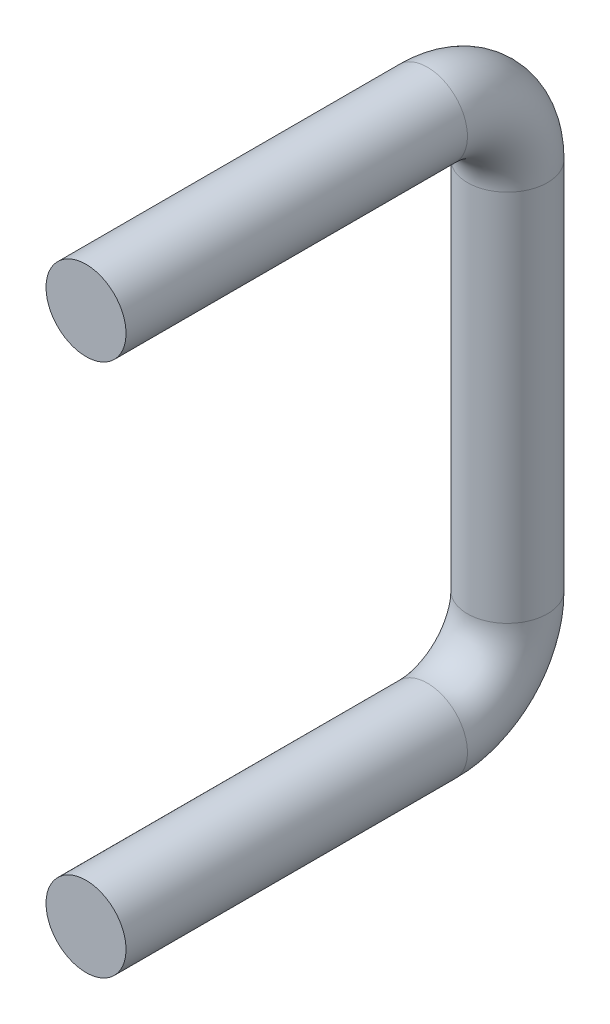
ISO-10303-21;
HEADER;
FILE_DESCRIPTION(('STEP AP214'),'2;1');
FILE_NAME('part.step','',(''),(''),'','','');
FILE_SCHEMA(('AUTOMOTIVE_DESIGN { 1 0 10303 214 1 1 1 1 }'));
ENDSEC;
DATA;
#1=APPLICATION_CONTEXT('core data for automotive mechanical design processes');
#2=APPLICATION_PROTOCOL_DEFINITION('international standard','automotive_design',2000,#1);
#3=PRODUCT_CONTEXT('',#1,'mechanical');
#4=PRODUCT('Part','Part','',(#3));
#5=PRODUCT_RELATED_PRODUCT_CATEGORY('part','',(#4));
#6=PRODUCT_DEFINITION_FORMATION('','',#4);
#7=PRODUCT_DEFINITION_CONTEXT('part definition',#1,'design');
#8=PRODUCT_DEFINITION('design','',#6,#7);
#9=PRODUCT_DEFINITION_SHAPE('','',#8);
#10=(LENGTH_UNIT() NAMED_UNIT(*) SI_UNIT(.MILLI.,.METRE.));
#11=(NAMED_UNIT(*) PLANE_ANGLE_UNIT() SI_UNIT($,.RADIAN.));
#12=(NAMED_UNIT(*) SI_UNIT($,.STERADIAN.) SOLID_ANGLE_UNIT());
#13=UNCERTAINTY_MEASURE_WITH_UNIT(LENGTH_MEASURE(1.E-05),#10,'distance_accuracy_value','');
#14=(GEOMETRIC_REPRESENTATION_CONTEXT(3) GLOBAL_UNCERTAINTY_ASSIGNED_CONTEXT((#13)) GLOBAL_UNIT_ASSIGNED_CONTEXT((#10,
#11,#12)) REPRESENTATION_CONTEXT('',''));
#15=CARTESIAN_POINT('',(0.,0.,0.));
#16=DIRECTION('',(0.,0.,1.));
#17=DIRECTION('',(1.,0.,0.));
#18=AXIS2_PLACEMENT_3D('',#15,#16,#17);
#19=CARTESIAN_POINT('',(0.,-6.12571966977016,-61.6303392434835));
#20=DIRECTION('',(0.,0.,-1.));
#21=DIRECTION('',(-1.,0.,0.));
#22=AXIS2_PLACEMENT_3D('',#19,#20,#21);
#23=PLANE('',#22);
#24=CARTESIAN_POINT('',(0.,-6.12571966977016,-61.6303392434835));
#25=DIRECTION('',(0.,0.,-1.));
#26=DIRECTION('',(-1.,0.,0.));
#27=AXIS2_PLACEMENT_3D('',#24,#25,#26);
#28=CIRCLE('',#27,7.5);
#29=CARTESIAN_POINT('',(-7.5,-6.12571966977016,-61.6303392434835));
#30=VERTEX_POINT('',#29);
#31=EDGE_CURVE('E64',#30,#30,#28,.T.);
#32=ORIENTED_EDGE('',*,*,#31,.F.);
#33=EDGE_LOOP('',(#32));
#34=FACE_BOUND('',#33,.T.);
#35=ADVANCED_FACE('F51',(#34),#23,.F.);
#36=CARTESIAN_POINT('',(0.,93.8742803302299,-61.6303392434835));
#37=DIRECTION('',(0.,0.,1.));
#38=DIRECTION('',(-1.,0.,0.));
#39=AXIS2_PLACEMENT_3D('',#36,#37,#38);
#40=PLANE('',#39);
#41=CARTESIAN_POINT('',(0.,93.8742803302299,-61.6303392434835));
#42=DIRECTION('',(0.,0.,1.));
#43=DIRECTION('',(-1.,0.,0.));
#44=AXIS2_PLACEMENT_3D('',#41,#42,#43);
#45=CIRCLE('',#44,7.5);
#46=CARTESIAN_POINT('',(-7.5,93.8742803302299,-61.6303392434835));
#47=VERTEX_POINT('',#46);
#48=EDGE_CURVE('E12',#47,#47,#45,.T.);
#49=ORIENTED_EDGE('',*,*,#48,.T.);
#50=EDGE_LOOP('',(#49));
#51=FACE_BOUND('',#50,.T.);
#52=ADVANCED_FACE('F67',(#51),#40,.T.);
#53=CARTESIAN_POINT('',(0.,-6.12571966977016,-61.6303392434835));
#54=DIRECTION('',(0.,0.,-1.));
#55=DIRECTION('',(-1.,0.,0.));
#56=AXIS2_PLACEMENT_3D('',#53,#54,#55);
#57=CYLINDRICAL_SURFACE('',#56,7.5);
#58=CARTESIAN_POINT('',(0.,-6.12571966977016,-125.630339243483));
#59=DIRECTION('',(0.,0.,-1.));
#60=DIRECTION('',(-1.,0.,0.));
#61=AXIS2_PLACEMENT_3D('',#58,#59,#60);
#62=CIRCLE('',#61,7.5);
#63=CARTESIAN_POINT('',(0.,-13.6257196697701,-125.630339243483));
#64=VERTEX_POINT('',#63);
#65=EDGE_CURVE('E87',#64,#64,#62,.T.);
#66=ORIENTED_EDGE('',*,*,#65,.F.);
#67=EDGE_LOOP('',(#66));
#68=FACE_BOUND('',#67,.T.);
#69=ORIENTED_EDGE('',*,*,#31,.T.);
#70=EDGE_LOOP('',(#69));
#71=FACE_BOUND('',#70,.T.);
#72=ADVANCED_FACE('F93',(#68,#71),#57,.T.);
#73=CARTESIAN_POINT('',(0.,8.87428033022985,-125.630339243483));
#74=DIRECTION('',(1.,0.,0.));
#75=DIRECTION('',(0.,0.,-1.));
#76=AXIS2_PLACEMENT_3D('',#73,#74,#75);
#77=TOROIDAL_SURFACE('',#76,15.,7.5);
#78=CARTESIAN_POINT('',(0.,8.87428033022985,-140.630339243483));
#79=DIRECTION('',(0.,1.,0.));
#80=DIRECTION('',(-1.,0.,0.));
#81=AXIS2_PLACEMENT_3D('',#78,#79,#80);
#82=CIRCLE('',#81,7.5);
#83=CARTESIAN_POINT('',(0.,8.87428033022985,-148.130339243483));
#84=VERTEX_POINT('',#83);
#85=EDGE_CURVE('E81',#84,#84,#82,.T.);
#86=CARTESIAN_POINT('',(0.,8.87428033022985,-125.630339243483));
#87=DIRECTION('',(1.,0.,0.));
#88=DIRECTION('',(0.,0.,-1.));
#89=AXIS2_PLACEMENT_3D('',#86,#87,#88);
#90=CIRCLE('',#89,22.5);
#91=EDGE_CURVE('',#64,#84,#90,.T.);
#92=ORIENTED_EDGE('',*,*,#65,.T.);
#93=ORIENTED_EDGE('',*,*,#85,.F.);
#94=ORIENTED_EDGE('',*,*,#91,.T.);
#95=ORIENTED_EDGE('',*,*,#91,.F.);
#96=EDGE_LOOP('',(#92,#94,#93,#95));
#97=FACE_BOUND('',#96,.T.);
#98=ADVANCED_FACE('F95',(#97),#77,.T.);
#99=CARTESIAN_POINT('',(0.,8.87428033022985,-140.630339243483));
#100=DIRECTION('',(0.,1.,0.));
#101=DIRECTION('',(0.,0.,1.));
#102=AXIS2_PLACEMENT_3D('',#99,#100,#101);
#103=CYLINDRICAL_SURFACE('',#102,7.5);
#104=CARTESIAN_POINT('',(0.,78.8742803302299,-140.630339243483));
#105=DIRECTION('',(0.,1.,0.));
#106=DIRECTION('',(-1.,0.,0.));
#107=AXIS2_PLACEMENT_3D('',#104,#105,#106);
#108=CIRCLE('',#107,7.5);
#109=CARTESIAN_POINT('',(0.,78.8742803302299,-148.130339243483));
#110=VERTEX_POINT('',#109);
#111=EDGE_CURVE('E78',#110,#110,#108,.T.);
#112=ORIENTED_EDGE('',*,*,#111,.F.);
#113=EDGE_LOOP('',(#112));
#114=FACE_BOUND('',#113,.T.);
#115=ORIENTED_EDGE('',*,*,#85,.T.);
#116=EDGE_LOOP('',(#115));
#117=FACE_BOUND('',#116,.T.);
#118=ADVANCED_FACE('F102',(#114,#117),#103,.T.);
#119=CARTESIAN_POINT('',(0.,78.8742803302299,-125.630339243483));
#120=DIRECTION('',(1.,0.,0.));
#121=DIRECTION('',(0.,0.,-1.));
#122=AXIS2_PLACEMENT_3D('',#119,#120,#121);
#123=TOROIDAL_SURFACE('',#122,15.,7.5);
#124=CARTESIAN_POINT('',(0.,93.8742803302299,-125.630339243483));
#125=DIRECTION('',(0.,0.,1.));
#126=DIRECTION('',(-1.,0.,0.));
#127=AXIS2_PLACEMENT_3D('',#124,#125,#126);
#128=CIRCLE('',#127,7.5);
#129=CARTESIAN_POINT('',(0.,101.37428033023,-125.630339243483));
#130=VERTEX_POINT('',#129);
#131=EDGE_CURVE('E59',#130,#130,#128,.T.);
#132=CARTESIAN_POINT('',(0.,78.8742803302299,-125.630339243483));
#133=DIRECTION('',(1.,0.,0.));
#134=DIRECTION('',(0.,0.,-1.));
#135=AXIS2_PLACEMENT_3D('',#132,#133,#134);
#136=CIRCLE('',#135,22.5);
#137=EDGE_CURVE('',#110,#130,#136,.T.);
#138=ORIENTED_EDGE('',*,*,#111,.T.);
#139=ORIENTED_EDGE('',*,*,#131,.F.);
#140=ORIENTED_EDGE('',*,*,#137,.T.);
#141=ORIENTED_EDGE('',*,*,#137,.F.);
#142=EDGE_LOOP('',(#138,#140,#139,#141));
#143=FACE_BOUND('',#142,.T.);
#144=ADVANCED_FACE('F72',(#143),#123,.T.);
#145=CARTESIAN_POINT('',(0.,93.8742803302299,-125.630339243483));
#146=DIRECTION('',(0.,0.,1.));
#147=DIRECTION('',(1.,0.,0.));
#148=AXIS2_PLACEMENT_3D('',#145,#146,#147);
#149=CYLINDRICAL_SURFACE('',#148,7.5);
#150=ORIENTED_EDGE('',*,*,#48,.F.);
#151=EDGE_LOOP('',(#150));
#152=FACE_BOUND('',#151,.T.);
#153=ORIENTED_EDGE('',*,*,#131,.T.);
#154=EDGE_LOOP('',(#153));
#155=FACE_BOUND('',#154,.T.);
#156=ADVANCED_FACE('F69',(#152,#155),#149,.T.);
#157=CLOSED_SHELL('',(#35,#52,#72,#98,#118,#144,#156));
#158=MANIFOLD_SOLID_BREP('B2',#157);
#159=ADVANCED_BREP_SHAPE_REPRESENTATION('',(#18,#158),#14);
#160=SHAPE_DEFINITION_REPRESENTATION(#9,#159);
ENDSEC;
END-ISO-10303-21;
